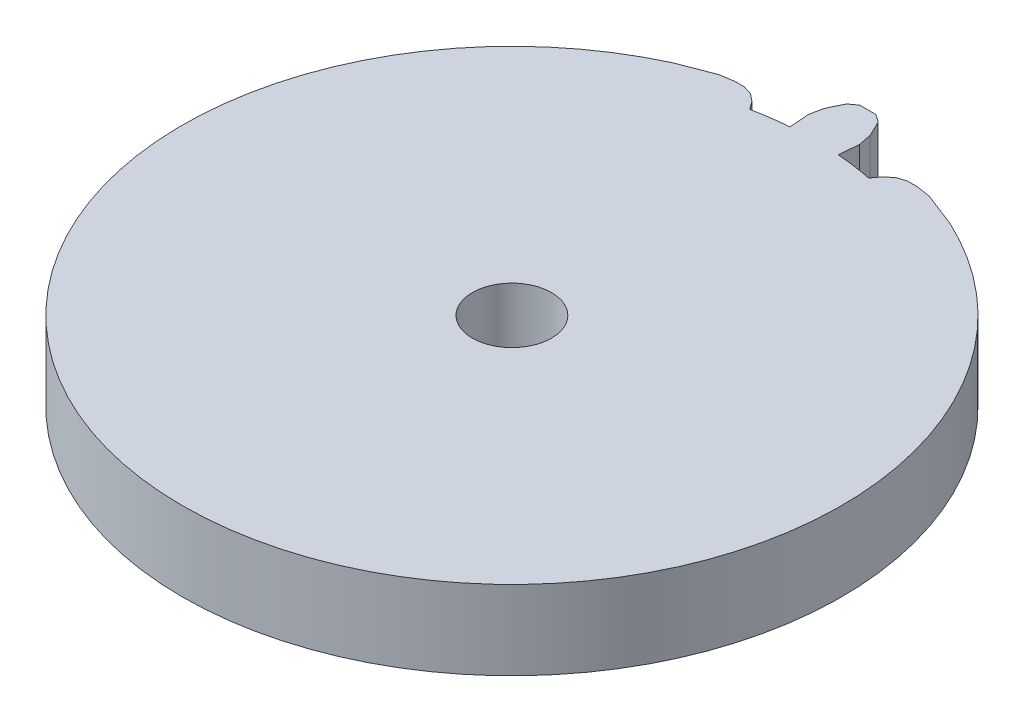
ISO-10303-21;
HEADER;
FILE_DESCRIPTION(('STEP AP214'),'2;1');
FILE_NAME('part.step','',(''),(''),'','','');
FILE_SCHEMA(('AUTOMOTIVE_DESIGN { 1 0 10303 214 1 1 1 1 }'));
ENDSEC;
DATA;
#1=APPLICATION_CONTEXT('core data for automotive mechanical design processes');
#2=APPLICATION_PROTOCOL_DEFINITION('international standard','automotive_design',2000,#1);
#3=PRODUCT_CONTEXT('',#1,'mechanical');
#4=PRODUCT('Part','Part','',(#3));
#5=PRODUCT_RELATED_PRODUCT_CATEGORY('part','',(#4));
#6=PRODUCT_DEFINITION_FORMATION('','',#4);
#7=PRODUCT_DEFINITION_CONTEXT('part definition',#1,'design');
#8=PRODUCT_DEFINITION('design','',#6,#7);
#9=PRODUCT_DEFINITION_SHAPE('','',#8);
#10=(LENGTH_UNIT() NAMED_UNIT(*) SI_UNIT(.MILLI.,.METRE.));
#11=(NAMED_UNIT(*) PLANE_ANGLE_UNIT() SI_UNIT($,.RADIAN.));
#12=(NAMED_UNIT(*) SI_UNIT($,.STERADIAN.) SOLID_ANGLE_UNIT());
#13=UNCERTAINTY_MEASURE_WITH_UNIT(LENGTH_MEASURE(1.E-05),#10,'distance_accuracy_value','');
#14=(GEOMETRIC_REPRESENTATION_CONTEXT(3) GLOBAL_UNCERTAINTY_ASSIGNED_CONTEXT((#13)) GLOBAL_UNIT_ASSIGNED_CONTEXT((#10,
#11,#12)) REPRESENTATION_CONTEXT('',''));
#15=CARTESIAN_POINT('',(0.,0.,0.));
#16=DIRECTION('',(0.,0.,1.));
#17=DIRECTION('',(1.,0.,0.));
#18=AXIS2_PLACEMENT_3D('',#15,#16,#17);
#19=CARTESIAN_POINT('',(-90.7746759823207,6.,-51.8445096665976));
#20=DIRECTION('',(0.,1.,0.));
#21=DIRECTION('',(0.,0.,1.));
#22=AXIS2_PLACEMENT_3D('',#19,#20,#21);
#23=PLANE('',#22);
#24=DIRECTION('',(-0.952984592312304,0.,0.303018756540502));
#25=VECTOR('',#24,1.);
#26=CARTESIAN_POINT('',(-85.5282944289775,6.,-75.3733161752729));
#27=LINE('',#26,#25);
#28=CARTESIAN_POINT('',(-84.59079600391,6.,-75.6714108237219));
#29=VERTEX_POINT('',#28);
#30=CARTESIAN_POINT('',(-85.2504317504003,6.,-75.4616676596838));
#31=VERTEX_POINT('',#30);
#32=EDGE_CURVE('E227',#29,#31,#27,.T.);
#33=ORIENTED_EDGE('',*,*,#32,.T.);
#34=DIRECTION('',(-0.778499469402873,0.,0.627645262978575));
#35=VECTOR('',#34,1.);
#36=CARTESIAN_POINT('',(-85.8165764895965,6.,-75.0052279603873));
#37=LINE('',#36,#35);
#38=CARTESIAN_POINT('',(-85.8165764895965,6.,-75.0052279603873));
#39=VERTEX_POINT('',#38);
#40=EDGE_CURVE('E371',#31,#39,#37,.T.);
#41=ORIENTED_EDGE('',*,*,#40,.T.);
#42=DIRECTION('',(-0.593111348272664,0.,0.805120443505307));
#43=VECTOR('',#42,1.);
#44=CARTESIAN_POINT('',(-84.965694111632,6.,-76.1602603156318));
#45=LINE('',#44,#43);
#46=CARTESIAN_POINT('',(-86.2640048761558,6.,-74.3978652078914));
#47=VERTEX_POINT('',#46);
#48=EDGE_CURVE('E261',#39,#47,#45,.T.);
#49=ORIENTED_EDGE('',*,*,#48,.T.);
#50=CARTESIAN_POINT('',(-90.7746759823207,6.,-51.8445096665976));
#51=DIRECTION('',(0.,1.,0.));
#52=DIRECTION('',(0.,0.,1.));
#53=AXIS2_PLACEMENT_3D('',#50,#51,#52);
#54=CIRCLE('',#53,22.9999999999999);
#55=CARTESIAN_POINT('',(-88.9405358698143,6.,-74.7712610729284));
#56=VERTEX_POINT('',#55);
#57=EDGE_CURVE('E287',#47,#56,#54,.T.);
#58=ORIENTED_EDGE('',*,*,#57,.T.);
#59=DIRECTION('',(0.0797452222828837,0.,-0.996815278536126));
#60=VECTOR('',#59,1.);
#61=CARTESIAN_POINT('',(-88.7810454252486,6.,-76.7648916300007));
#62=LINE('',#61,#60);
#63=CARTESIAN_POINT('',(-88.8208552253991,6.,-76.2672691281194));
#64=VERTEX_POINT('',#63);
#65=EDGE_CURVE('E283',#56,#64,#62,.T.);
#66=ORIENTED_EDGE('',*,*,#65,.T.);
#67=DIRECTION('',(-0.194233291171747,0.,-0.980955365243797));
#68=VECTOR('',#67,1.);
#69=CARTESIAN_POINT('',(-88.8208552253991,6.,-76.2672691281194));
#70=LINE('',#69,#68);
#71=CARTESIAN_POINT('',(-89.0172888523159,6.,-77.2593370639298));
#72=VERTEX_POINT('',#71);
#73=EDGE_CURVE('E354',#64,#72,#70,.T.);
#74=ORIENTED_EDGE('',*,*,#73,.T.);
#75=DIRECTION('',(-0.431113171841939,0.,-0.902297862717397));
#76=VECTOR('',#75,1.);
#77=CARTESIAN_POINT('',(-88.7810454252486,6.,-76.7648916300007));
#78=LINE('',#77,#76);
#79=CARTESIAN_POINT('',(-89.5731249178315,6.,-78.4226735766909));
#80=VERTEX_POINT('',#79);
#81=EDGE_CURVE('E286',#72,#80,#78,.T.);
#82=ORIENTED_EDGE('',*,*,#81,.T.);
#83=DIRECTION('',(-0.809342169613385,0.,-0.58733742643007));
#84=VECTOR('',#83,1.);
#85=CARTESIAN_POINT('',(-89.5731249178315,6.,-78.4226735766909));
#86=LINE('',#85,#84);
#87=CARTESIAN_POINT('',(-90.1544087265298,6.,-78.8445096665976));
#88=VERTEX_POINT('',#87);
#89=EDGE_CURVE('E344',#80,#88,#86,.T.);
#90=ORIENTED_EDGE('',*,*,#89,.T.);
#91=DIRECTION('',(-1.,0.,0.));
#92=VECTOR('',#91,1.);
#93=CARTESIAN_POINT('',(-89.7746759823208,6.,-78.8445096665976));
#94=LINE('',#93,#92);
#95=CARTESIAN_POINT('',(-91.3949432381118,6.,-78.8445096665976));
#96=VERTEX_POINT('',#95);
#97=EDGE_CURVE('E294',#88,#96,#94,.T.);
#98=ORIENTED_EDGE('',*,*,#97,.T.);
#99=DIRECTION('',(-0.809342169613385,0.,0.58733742643007));
#100=VECTOR('',#99,1.);
#101=CARTESIAN_POINT('',(-91.9762270468101,6.,-78.4226735766909));
#102=LINE('',#101,#100);
#103=CARTESIAN_POINT('',(-91.9762270468101,6.,-78.4226735766909));
#104=VERTEX_POINT('',#103);
#105=EDGE_CURVE('E333',#96,#104,#102,.T.);
#106=ORIENTED_EDGE('',*,*,#105,.T.);
#107=DIRECTION('',(-0.431113171841939,0.,0.902297862717397));
#108=VECTOR('',#107,1.);
#109=CARTESIAN_POINT('',(-92.7683065393931,6.,-76.7648916300007));
#110=LINE('',#109,#108);
#111=CARTESIAN_POINT('',(-92.5320631123257,6.,-77.2593370639298));
#112=VERTEX_POINT('',#111);
#113=EDGE_CURVE('E291',#104,#112,#110,.T.);
#114=ORIENTED_EDGE('',*,*,#113,.T.);
#115=DIRECTION('',(-0.194233291171734,0.,0.9809553652438));
#116=VECTOR('',#115,1.);
#117=CARTESIAN_POINT('',(-92.7284967392425,6.,-76.2672691281194));
#118=LINE('',#117,#116);
#119=CARTESIAN_POINT('',(-92.7284967392425,6.,-76.2672691281194));
#120=VERTEX_POINT('',#119);
#121=EDGE_CURVE('E322',#112,#120,#118,.T.);
#122=ORIENTED_EDGE('',*,*,#121,.T.);
#123=DIRECTION('',(0.0797452222828928,0.,0.996815278536125));
#124=VECTOR('',#123,1.);
#125=CARTESIAN_POINT('',(-92.7683065393931,6.,-76.7648916300007));
#126=LINE('',#125,#124);
#127=CARTESIAN_POINT('',(-92.6088160948273,6.,-74.7712610729285));
#128=VERTEX_POINT('',#127);
#129=EDGE_CURVE('E245',#120,#128,#126,.T.);
#130=ORIENTED_EDGE('',*,*,#129,.T.);
#131=CARTESIAN_POINT('',(-90.7746759823207,6.,-51.8445096665976));
#132=DIRECTION('',(0.,1.,0.));
#133=DIRECTION('',(0.,0.,1.));
#134=AXIS2_PLACEMENT_3D('',#131,#132,#133);
#135=CIRCLE('',#134,23.);
#136=CARTESIAN_POINT('',(-95.2853470884858,6.,-74.3978652078914));
#137=VERTEX_POINT('',#136);
#138=EDGE_CURVE('E241',#128,#137,#135,.T.);
#139=ORIENTED_EDGE('',*,*,#138,.T.);
#140=DIRECTION('',(-0.593111348272664,0.,-0.805120443505307));
#141=VECTOR('',#140,1.);
#142=CARTESIAN_POINT('',(-96.5836578530096,6.,-76.1602603156318));
#143=LINE('',#142,#141);
#144=CARTESIAN_POINT('',(-95.7327754750451,6.,-75.0052279603873));
#145=VERTEX_POINT('',#144);
#146=EDGE_CURVE('E236',#137,#145,#143,.T.);
#147=ORIENTED_EDGE('',*,*,#146,.T.);
#148=DIRECTION('',(-0.778499469402873,0.,-0.627645262978575));
#149=VECTOR('',#148,1.);
#150=CARTESIAN_POINT('',(-95.7327754750451,6.,-75.0052279603873));
#151=LINE('',#150,#149);
#152=CARTESIAN_POINT('',(-96.2989202142413,6.,-75.4616676596838));
#153=VERTEX_POINT('',#152);
#154=EDGE_CURVE('E363',#145,#153,#151,.T.);
#155=ORIENTED_EDGE('',*,*,#154,.T.);
#156=DIRECTION('',(-0.952984592312304,0.,-0.303018756540502));
#157=VECTOR('',#156,1.);
#158=CARTESIAN_POINT('',(-96.0210575356641,6.,-75.3733161752729));
#159=LINE('',#158,#157);
#160=CARTESIAN_POINT('',(-96.9585559607316,6.,-75.6714108237219));
#161=VERTEX_POINT('',#160);
#162=EDGE_CURVE('E52',#153,#161,#159,.T.);
#163=ORIENTED_EDGE('',*,*,#162,.T.);
#164=DIRECTION('',(-1.,0.,0.));
#165=VECTOR('',#164,1.);
#166=CARTESIAN_POINT('',(-96.9585559607316,6.,-75.6714108237219));
#167=LINE('',#166,#165);
#168=CARTESIAN_POINT('',(-97.6878845414726,6.,-75.6714108237219));
#169=VERTEX_POINT('',#168);
#170=EDGE_CURVE('E405',#161,#169,#167,.T.);
#171=ORIENTED_EDGE('',*,*,#170,.T.);
#172=DIRECTION('',(-0.987910704749329,0.,0.15502399634148));
#173=VECTOR('',#172,1.);
#174=CARTESIAN_POINT('',(-97.6878845414726,6.,-75.6714108237219));
#175=LINE('',#174,#173);
#176=CARTESIAN_POINT('',(-98.7702244107247,6.,-75.501568902661));
#177=VERTEX_POINT('',#176);
#178=EDGE_CURVE('E402',#169,#177,#175,.T.);
#179=ORIENTED_EDGE('',*,*,#178,.T.);
#180=DIRECTION('',(-0.931576817700719,0.,0.363544540218392));
#181=VECTOR('',#180,1.);
#182=CARTESIAN_POINT('',(-98.7702244107247,6.,-75.501568902661));
#183=LINE('',#182,#181);
#184=CARTESIAN_POINT('',(-100.13489394785,6.,-74.9690114688589));
#185=VERTEX_POINT('',#184);
#186=EDGE_CURVE('E400',#177,#185,#183,.T.);
#187=ORIENTED_EDGE('',*,*,#186,.T.);
#188=DIRECTION('',(-0.933303555268989,0.,0.35908839263093));
#189=VECTOR('',#188,1.);
#190=CARTESIAN_POINT('',(-100.13489394785,6.,-74.9690114688589));
#191=LINE('',#190,#189);
#192=CARTESIAN_POINT('',(-101.301738293158,6.,-74.5200682948597));
#193=VERTEX_POINT('',#192);
#194=EDGE_CURVE('E234',#185,#193,#191,.T.);
#195=ORIENTED_EDGE('',*,*,#194,.T.);
#196=CARTESIAN_POINT('',(-90.7746759823207,6.,-51.8445096665976));
#197=DIRECTION('',(0.,1.,0.));
#198=DIRECTION('',(0.,0.,1.));
#199=AXIS2_PLACEMENT_3D('',#196,#197,#198);
#200=CIRCLE('',#199,25.);
#201=CARTESIAN_POINT('',(-80.2476136714834,6.,-74.5200682948597));
#202=VERTEX_POINT('',#201);
#203=EDGE_CURVE('E38',#193,#202,#200,.T.);
#204=ORIENTED_EDGE('',*,*,#203,.T.);
#205=DIRECTION('',(-0.933303555268989,0.,-0.35908839263093));
#206=VECTOR('',#205,1.);
#207=CARTESIAN_POINT('',(-81.4144580167916,6.,-74.9690114688589));
#208=LINE('',#207,#206);
#209=CARTESIAN_POINT('',(-81.4144580167916,6.,-74.9690114688589));
#210=VERTEX_POINT('',#209);
#211=EDGE_CURVE('E208',#202,#210,#208,.T.);
#212=ORIENTED_EDGE('',*,*,#211,.T.);
#213=DIRECTION('',(-0.931576817700719,0.,-0.363544540218392));
#214=VECTOR('',#213,1.);
#215=CARTESIAN_POINT('',(-82.779127553917,6.,-75.5015689026611));
#216=LINE('',#215,#214);
#217=CARTESIAN_POINT('',(-82.779127553917,6.,-75.5015689026611));
#218=VERTEX_POINT('',#217);
#219=EDGE_CURVE('E219',#210,#218,#216,.T.);
#220=ORIENTED_EDGE('',*,*,#219,.T.);
#221=DIRECTION('',(-0.987910704749329,0.,-0.15502399634148));
#222=VECTOR('',#221,1.);
#223=CARTESIAN_POINT('',(-83.861467423169,6.,-75.6714108237219));
#224=LINE('',#223,#222);
#225=CARTESIAN_POINT('',(-83.861467423169,6.,-75.6714108237219));
#226=VERTEX_POINT('',#225);
#227=EDGE_CURVE('E430',#218,#226,#224,.T.);
#228=ORIENTED_EDGE('',*,*,#227,.T.);
#229=DIRECTION('',(-1.,0.,0.));
#230=VECTOR('',#229,1.);
#231=CARTESIAN_POINT('',(-84.59079600391,6.,-75.6714108237219));
#232=LINE('',#231,#230);
#233=EDGE_CURVE('E427',#226,#29,#232,.T.);
#234=ORIENTED_EDGE('',*,*,#233,.T.);
#235=EDGE_LOOP('',(#33,#41,#49,#58,#66,#74,#82,#90,#98,#106,#114,#122,#130,#139,#147,#155,#163,
#171,#179,#187,#195,#204,#212,#220,#228,#234));
#236=FACE_BOUND('',#235,.T.);
#237=CARTESIAN_POINT('',(-90.7746759823207,6.,-51.8445096665976));
#238=DIRECTION('',(0.,1.,0.));
#239=DIRECTION('',(0.,0.,1.));
#240=AXIS2_PLACEMENT_3D('',#237,#238,#239);
#241=CIRCLE('',#240,2.99999999999994);
#242=CARTESIAN_POINT('',(-90.7746759823207,6.,-48.8445096665977));
#243=VERTEX_POINT('',#242);
#244=EDGE_CURVE('E260',#243,#243,#241,.T.);
#245=ORIENTED_EDGE('',*,*,#244,.F.);
#246=EDGE_LOOP('',(#245));
#247=FACE_BOUND('',#246,.T.);
#248=ADVANCED_FACE('F34',(#236,#247),#23,.T.);
#249=CARTESIAN_POINT('',(-90.7746759823207,0.,-51.8445096665976));
#250=DIRECTION('',(0.,1.,0.));
#251=DIRECTION('',(0.,0.,1.));
#252=AXIS2_PLACEMENT_3D('',#249,#250,#251);
#253=PLANE('',#252);
#254=DIRECTION('',(-0.778499469402873,0.,0.627645262978575));
#255=VECTOR('',#254,1.);
#256=CARTESIAN_POINT('',(-85.8165764895965,0.,-75.0052279603873));
#257=LINE('',#256,#255);
#258=CARTESIAN_POINT('',(-85.2504317504003,0.,-75.4616676596838));
#259=VERTEX_POINT('',#258);
#260=CARTESIAN_POINT('',(-85.8165764895965,0.,-75.0052279603873));
#261=VERTEX_POINT('',#260);
#262=EDGE_CURVE('E362',#259,#261,#257,.T.);
#263=ORIENTED_EDGE('',*,*,#262,.F.);
#264=DIRECTION('',(-0.952984592312304,0.,0.303018756540502));
#265=VECTOR('',#264,1.);
#266=CARTESIAN_POINT('',(-85.5282944289775,0.,-75.3733161752729));
#267=LINE('',#266,#265);
#268=CARTESIAN_POINT('',(-84.59079600391,0.,-75.6714108237219));
#269=VERTEX_POINT('',#268);
#270=EDGE_CURVE('E59',#269,#259,#267,.T.);
#271=ORIENTED_EDGE('',*,*,#270,.F.);
#272=DIRECTION('',(-1.,0.,0.));
#273=VECTOR('',#272,1.);
#274=CARTESIAN_POINT('',(-84.59079600391,0.,-75.6714108237219));
#275=LINE('',#274,#273);
#276=CARTESIAN_POINT('',(-83.861467423169,0.,-75.6714108237219));
#277=VERTEX_POINT('',#276);
#278=EDGE_CURVE('E416',#277,#269,#275,.T.);
#279=ORIENTED_EDGE('',*,*,#278,.F.);
#280=DIRECTION('',(-0.987910704749329,0.,-0.15502399634148));
#281=VECTOR('',#280,1.);
#282=CARTESIAN_POINT('',(-83.861467423169,0.,-75.6714108237219));
#283=LINE('',#282,#281);
#284=CARTESIAN_POINT('',(-82.779127553917,0.,-75.5015689026611));
#285=VERTEX_POINT('',#284);
#286=EDGE_CURVE('E419',#285,#277,#283,.T.);
#287=ORIENTED_EDGE('',*,*,#286,.F.);
#288=DIRECTION('',(-0.931576817700719,0.,-0.363544540218392));
#289=VECTOR('',#288,1.);
#290=CARTESIAN_POINT('',(-82.779127553917,0.,-75.5015689026611));
#291=LINE('',#290,#289);
#292=CARTESIAN_POINT('',(-81.4144580167916,0.,-74.9690114688589));
#293=VERTEX_POINT('',#292);
#294=EDGE_CURVE('E422',#293,#285,#291,.T.);
#295=ORIENTED_EDGE('',*,*,#294,.F.);
#296=DIRECTION('',(-0.933303555268989,0.,-0.35908839263093));
#297=VECTOR('',#296,1.);
#298=CARTESIAN_POINT('',(-81.4144580167916,0.,-74.9690114688589));
#299=LINE('',#298,#297);
#300=CARTESIAN_POINT('',(-80.2476136714834,0.,-74.5200682948597));
#301=VERTEX_POINT('',#300);
#302=EDGE_CURVE('E385',#301,#293,#299,.T.);
#303=ORIENTED_EDGE('',*,*,#302,.F.);
#304=CARTESIAN_POINT('',(-90.7746759823207,0.,-51.8445096665976));
#305=DIRECTION('',(0.,1.,0.));
#306=DIRECTION('',(0.,0.,1.));
#307=AXIS2_PLACEMENT_3D('',#304,#305,#306);
#308=CIRCLE('',#307,25.);
#309=CARTESIAN_POINT('',(-101.301738293158,0.,-74.5200682948597));
#310=VERTEX_POINT('',#309);
#311=EDGE_CURVE('E226',#310,#301,#308,.T.);
#312=ORIENTED_EDGE('',*,*,#311,.F.);
#313=DIRECTION('',(-0.933303555268989,0.,0.35908839263093));
#314=VECTOR('',#313,1.);
#315=CARTESIAN_POINT('',(-100.13489394785,0.,-74.9690114688589));
#316=LINE('',#315,#314);
#317=CARTESIAN_POINT('',(-100.13489394785,0.,-74.9690114688589));
#318=VERTEX_POINT('',#317);
#319=EDGE_CURVE('E386',#318,#310,#316,.T.);
#320=ORIENTED_EDGE('',*,*,#319,.F.);
#321=DIRECTION('',(-0.931576817700719,0.,0.363544540218392));
#322=VECTOR('',#321,1.);
#323=CARTESIAN_POINT('',(-98.7702244107247,0.,-75.501568902661));
#324=LINE('',#323,#322);
#325=CARTESIAN_POINT('',(-98.7702244107247,0.,-75.501568902661));
#326=VERTEX_POINT('',#325);
#327=EDGE_CURVE('E388',#326,#318,#324,.T.);
#328=ORIENTED_EDGE('',*,*,#327,.F.);
#329=DIRECTION('',(-0.987910704749329,0.,0.15502399634148));
#330=VECTOR('',#329,1.);
#331=CARTESIAN_POINT('',(-97.6878845414726,0.,-75.6714108237219));
#332=LINE('',#331,#330);
#333=CARTESIAN_POINT('',(-97.6878845414726,0.,-75.6714108237219));
#334=VERTEX_POINT('',#333);
#335=EDGE_CURVE('E391',#334,#326,#332,.T.);
#336=ORIENTED_EDGE('',*,*,#335,.F.);
#337=DIRECTION('',(-1.,0.,0.));
#338=VECTOR('',#337,1.);
#339=CARTESIAN_POINT('',(-96.9585559607316,0.,-75.6714108237219));
#340=LINE('',#339,#338);
#341=CARTESIAN_POINT('',(-96.9585559607316,0.,-75.6714108237219));
#342=VERTEX_POINT('',#341);
#343=EDGE_CURVE('E394',#342,#334,#340,.T.);
#344=ORIENTED_EDGE('',*,*,#343,.F.);
#345=DIRECTION('',(-0.952984592312304,0.,-0.303018756540502));
#346=VECTOR('',#345,1.);
#347=CARTESIAN_POINT('',(-96.0210575356641,0.,-75.3733161752729));
#348=LINE('',#347,#346);
#349=CARTESIAN_POINT('',(-96.2989202142413,0.,-75.4616676596838));
#350=VERTEX_POINT('',#349);
#351=EDGE_CURVE('E397',#350,#342,#348,.T.);
#352=ORIENTED_EDGE('',*,*,#351,.F.);
#353=DIRECTION('',(-0.778499469402873,0.,-0.627645262978575));
#354=VECTOR('',#353,1.);
#355=CARTESIAN_POINT('',(-95.7327754750451,0.,-75.0052279603873));
#356=LINE('',#355,#354);
#357=CARTESIAN_POINT('',(-95.7327754750451,0.,-75.0052279603873));
#358=VERTEX_POINT('',#357);
#359=EDGE_CURVE('E364',#358,#350,#356,.T.);
#360=ORIENTED_EDGE('',*,*,#359,.F.);
#361=DIRECTION('',(-0.593111348272664,0.,-0.805120443505307));
#362=VECTOR('',#361,1.);
#363=CARTESIAN_POINT('',(-96.5836578530096,0.,-76.1602603156318));
#364=LINE('',#363,#362);
#365=CARTESIAN_POINT('',(-95.2853470884858,0.,-74.3978652078914));
#366=VERTEX_POINT('',#365);
#367=EDGE_CURVE('E259',#366,#358,#364,.T.);
#368=ORIENTED_EDGE('',*,*,#367,.F.);
#369=CARTESIAN_POINT('',(-90.7746759823207,0.,-51.8445096665976));
#370=DIRECTION('',(0.,1.,0.));
#371=DIRECTION('',(0.,0.,1.));
#372=AXIS2_PLACEMENT_3D('',#369,#370,#371);
#373=CIRCLE('',#372,23.);
#374=CARTESIAN_POINT('',(-92.6088160948273,0.,-74.7712610729285));
#375=VERTEX_POINT('',#374);
#376=EDGE_CURVE('E270',#375,#366,#373,.T.);
#377=ORIENTED_EDGE('',*,*,#376,.F.);
#378=DIRECTION('',(0.0797452222828928,0.,0.996815278536125));
#379=VECTOR('',#378,1.);
#380=CARTESIAN_POINT('',(-92.7683065393931,0.,-76.7648916300007));
#381=LINE('',#380,#379);
#382=CARTESIAN_POINT('',(-92.7284967392425,0.,-76.2672691281194));
#383=VERTEX_POINT('',#382);
#384=EDGE_CURVE('E273',#383,#375,#381,.T.);
#385=ORIENTED_EDGE('',*,*,#384,.F.);
#386=DIRECTION('',(-0.194233291171734,0.,0.9809553652438));
#387=VECTOR('',#386,1.);
#388=CARTESIAN_POINT('',(-92.7284967392425,0.,-76.2672691281194));
#389=LINE('',#388,#387);
#390=CARTESIAN_POINT('',(-92.5320631123257,0.,-77.2593370639298));
#391=VERTEX_POINT('',#390);
#392=EDGE_CURVE('E331',#391,#383,#389,.T.);
#393=ORIENTED_EDGE('',*,*,#392,.F.);
#394=DIRECTION('',(-0.431113171841939,0.,0.902297862717397));
#395=VECTOR('',#394,1.);
#396=CARTESIAN_POINT('',(-92.7683065393931,0.,-76.7648916300007));
#397=LINE('',#396,#395);
#398=CARTESIAN_POINT('',(-91.9762270468101,0.,-78.4226735766909));
#399=VERTEX_POINT('',#398);
#400=EDGE_CURVE('E275',#399,#391,#397,.T.);
#401=ORIENTED_EDGE('',*,*,#400,.F.);
#402=DIRECTION('',(-0.809342169613385,0.,0.58733742643007));
#403=VECTOR('',#402,1.);
#404=CARTESIAN_POINT('',(-91.9762270468101,0.,-78.4226735766909));
#405=LINE('',#404,#403);
#406=CARTESIAN_POINT('',(-91.3949432381118,0.,-78.8445096665976));
#407=VERTEX_POINT('',#406);
#408=EDGE_CURVE('E334',#407,#399,#405,.T.);
#409=ORIENTED_EDGE('',*,*,#408,.F.);
#410=DIRECTION('',(-1.,0.,0.));
#411=VECTOR('',#410,1.);
#412=CARTESIAN_POINT('',(-89.7746759823208,0.,-78.8445096665976));
#413=LINE('',#412,#411);
#414=CARTESIAN_POINT('',(-90.1544087265298,0.,-78.8445096665976));
#415=VERTEX_POINT('',#414);
#416=EDGE_CURVE('E278',#415,#407,#413,.T.);
#417=ORIENTED_EDGE('',*,*,#416,.F.);
#418=DIRECTION('',(-0.809342169613385,0.,-0.58733742643007));
#419=VECTOR('',#418,1.);
#420=CARTESIAN_POINT('',(-89.5731249178315,0.,-78.4226735766909));
#421=LINE('',#420,#419);
#422=CARTESIAN_POINT('',(-89.5731249178315,0.,-78.4226735766909));
#423=VERTEX_POINT('',#422);
#424=EDGE_CURVE('E352',#423,#415,#421,.T.);
#425=ORIENTED_EDGE('',*,*,#424,.F.);
#426=DIRECTION('',(-0.431113171841939,0.,-0.902297862717397));
#427=VECTOR('',#426,1.);
#428=CARTESIAN_POINT('',(-88.7810454252486,0.,-76.7648916300007));
#429=LINE('',#428,#427);
#430=CARTESIAN_POINT('',(-89.0172888523159,0.,-77.2593370639298));
#431=VERTEX_POINT('',#430);
#432=EDGE_CURVE('E238',#431,#423,#429,.T.);
#433=ORIENTED_EDGE('',*,*,#432,.F.);
#434=DIRECTION('',(-0.194233291171747,0.,-0.980955365243797));
#435=VECTOR('',#434,1.);
#436=CARTESIAN_POINT('',(-88.8208552253991,0.,-76.2672691281194));
#437=LINE('',#436,#435);
#438=CARTESIAN_POINT('',(-88.8208552253991,0.,-76.2672691281194));
#439=VERTEX_POINT('',#438);
#440=EDGE_CURVE('E330',#439,#431,#437,.T.);
#441=ORIENTED_EDGE('',*,*,#440,.F.);
#442=DIRECTION('',(0.0797452222828837,0.,-0.996815278536126));
#443=VECTOR('',#442,1.);
#444=CARTESIAN_POINT('',(-88.7810454252486,0.,-76.7648916300007));
#445=LINE('',#444,#443);
#446=CARTESIAN_POINT('',(-88.9405358698143,0.,-74.7712610729284));
#447=VERTEX_POINT('',#446);
#448=EDGE_CURVE('E305',#447,#439,#445,.T.);
#449=ORIENTED_EDGE('',*,*,#448,.F.);
#450=CARTESIAN_POINT('',(-90.7746759823207,0.,-51.8445096665976));
#451=DIRECTION('',(0.,1.,0.));
#452=DIRECTION('',(0.,0.,1.));
#453=AXIS2_PLACEMENT_3D('',#450,#451,#452);
#454=CIRCLE('',#453,22.9999999999999);
#455=CARTESIAN_POINT('',(-86.2640048761558,0.,-74.3978652078914));
#456=VERTEX_POINT('',#455);
#457=EDGE_CURVE('E264',#456,#447,#454,.T.);
#458=ORIENTED_EDGE('',*,*,#457,.F.);
#459=DIRECTION('',(-0.593111348272664,0.,0.805120443505307));
#460=VECTOR('',#459,1.);
#461=CARTESIAN_POINT('',(-84.965694111632,0.,-76.1602603156318));
#462=LINE('',#461,#460);
#463=EDGE_CURVE('E256',#261,#456,#462,.T.);
#464=ORIENTED_EDGE('',*,*,#463,.F.);
#465=EDGE_LOOP('',(#263,#271,#279,#287,#295,#303,#312,#320,#328,#336,#344,#352,#360,#368,#377,
#385,#393,#401,#409,#417,#425,#433,#441,#449,#458,#464));
#466=FACE_BOUND('',#465,.T.);
#467=CARTESIAN_POINT('',(-90.7746759823207,0.,-51.8445096665976));
#468=DIRECTION('',(0.,1.,0.));
#469=DIRECTION('',(0.,0.,1.));
#470=AXIS2_PLACEMENT_3D('',#467,#468,#469);
#471=CIRCLE('',#470,2.99999999999994);
#472=CARTESIAN_POINT('',(-90.7746759823207,0.,-48.8445096665977));
#473=VERTEX_POINT('',#472);
#474=EDGE_CURVE('E235',#473,#473,#471,.T.);
#475=ORIENTED_EDGE('',*,*,#474,.T.);
#476=EDGE_LOOP('',(#475));
#477=FACE_BOUND('',#476,.T.);
#478=ADVANCED_FACE('F466',(#466,#477),#253,.F.);
#479=CARTESIAN_POINT('',(-88.7810454252486,6.,-76.7648916300007));
#480=DIRECTION('',(-0.902297862717397,0.,0.431113171841939));
#481=DIRECTION('',(0.431113171841939,0.,0.902297862717397));
#482=AXIS2_PLACEMENT_3D('',#479,#480,#481);
#483=PLANE('',#482);
#484=ORIENTED_EDGE('',*,*,#432,.T.);
#485=DIRECTION('',(0.,-1.,0.));
#486=VECTOR('',#485,1.);
#487=CARTESIAN_POINT('',(-89.5731249178315,6.,-78.4226735766909));
#488=LINE('',#487,#486);
#489=EDGE_CURVE('E347',#80,#423,#488,.T.);
#490=ORIENTED_EDGE('',*,*,#489,.F.);
#491=ORIENTED_EDGE('',*,*,#81,.F.);
#492=DIRECTION('',(0.,-1.,0.));
#493=VECTOR('',#492,1.);
#494=CARTESIAN_POINT('',(-89.0172888523159,6.,-77.2593370639298));
#495=LINE('',#494,#493);
#496=EDGE_CURVE('E343',#72,#431,#495,.T.);
#497=ORIENTED_EDGE('',*,*,#496,.T.);
#498=EDGE_LOOP('',(#484,#490,#491,#497));
#499=FACE_BOUND('',#498,.T.);
#500=ADVANCED_FACE('F472',(#499),#483,.F.);
#501=CARTESIAN_POINT('',(-89.7746759823208,6.,-78.8445096665976));
#502=DIRECTION('',(0.,0.,1.));
#503=DIRECTION('',(1.,0.,0.));
#504=AXIS2_PLACEMENT_3D('',#501,#502,#503);
#505=PLANE('',#504);
#506=ORIENTED_EDGE('',*,*,#97,.F.);
#507=DIRECTION('',(0.,-1.,0.));
#508=VECTOR('',#507,1.);
#509=CARTESIAN_POINT('',(-90.1544087265298,6.,-78.8445096665976));
#510=LINE('',#509,#508);
#511=EDGE_CURVE('E349',#88,#415,#510,.T.);
#512=ORIENTED_EDGE('',*,*,#511,.T.);
#513=ORIENTED_EDGE('',*,*,#416,.T.);
#514=DIRECTION('',(0.,-1.,0.));
#515=VECTOR('',#514,1.);
#516=CARTESIAN_POINT('',(-91.3949432381118,6.,-78.8445096665976));
#517=LINE('',#516,#515);
#518=EDGE_CURVE('E319',#96,#407,#517,.T.);
#519=ORIENTED_EDGE('',*,*,#518,.F.);
#520=EDGE_LOOP('',(#506,#512,#513,#519));
#521=FACE_BOUND('',#520,.T.);
#522=ADVANCED_FACE('F478',(#521),#505,.F.);
#523=CARTESIAN_POINT('',(-92.7683065393931,6.,-76.7648916300007));
#524=DIRECTION('',(0.902297862717397,0.,0.431113171841939));
#525=DIRECTION('',(0.431113171841939,0.,-0.902297862717397));
#526=AXIS2_PLACEMENT_3D('',#523,#524,#525);
#527=PLANE('',#526);
#528=ORIENTED_EDGE('',*,*,#400,.T.);
#529=DIRECTION('',(0.,-1.,0.));
#530=VECTOR('',#529,1.);
#531=CARTESIAN_POINT('',(-92.5320631123257,6.,-77.2593370639298));
#532=LINE('',#531,#530);
#533=EDGE_CURVE('E325',#112,#391,#532,.T.);
#534=ORIENTED_EDGE('',*,*,#533,.F.);
#535=ORIENTED_EDGE('',*,*,#113,.F.);
#536=DIRECTION('',(0.,-1.,0.));
#537=VECTOR('',#536,1.);
#538=CARTESIAN_POINT('',(-91.9762270468101,6.,-78.4226735766909));
#539=LINE('',#538,#537);
#540=EDGE_CURVE('E321',#104,#399,#539,.T.);
#541=ORIENTED_EDGE('',*,*,#540,.T.);
#542=EDGE_LOOP('',(#528,#534,#535,#541));
#543=FACE_BOUND('',#542,.T.);
#544=ADVANCED_FACE('F487',(#543),#527,.F.);
#545=CARTESIAN_POINT('',(-92.7683065393931,6.,-76.7648916300007));
#546=DIRECTION('',(0.996815278536125,0.,-0.0797452222828928));
#547=DIRECTION('',(-0.0797452222828928,0.,-0.996815278536125));
#548=AXIS2_PLACEMENT_3D('',#545,#546,#547);
#549=PLANE('',#548);
#550=ORIENTED_EDGE('',*,*,#129,.F.);
#551=DIRECTION('',(0.,-1.,0.));
#552=VECTOR('',#551,1.);
#553=CARTESIAN_POINT('',(-92.7284967392425,6.,-76.2672691281194));
#554=LINE('',#553,#552);
#555=EDGE_CURVE('E327',#120,#383,#554,.T.);
#556=ORIENTED_EDGE('',*,*,#555,.T.);
#557=ORIENTED_EDGE('',*,*,#384,.T.);
#558=DIRECTION('',(0.,-1.,0.));
#559=VECTOR('',#558,1.);
#560=CARTESIAN_POINT('',(-92.6088160948273,6.,-74.7712610729285));
#561=LINE('',#560,#559);
#562=EDGE_CURVE('E265',#128,#375,#561,.T.);
#563=ORIENTED_EDGE('',*,*,#562,.F.);
#564=EDGE_LOOP('',(#550,#556,#557,#563));
#565=FACE_BOUND('',#564,.T.);
#566=ADVANCED_FACE('F493',(#565),#549,.F.);
#567=CARTESIAN_POINT('',(-90.7746759823207,6.,-51.8445096665976));
#568=DIRECTION('',(0.,-1.,0.));
#569=DIRECTION('',(0.,0.,-1.));
#570=AXIS2_PLACEMENT_3D('',#567,#568,#569);
#571=CYLINDRICAL_SURFACE('',#570,23.);
#572=ORIENTED_EDGE('',*,*,#376,.T.);
#573=DIRECTION('',(0.,-1.,0.));
#574=VECTOR('',#573,1.);
#575=CARTESIAN_POINT('',(-95.2853470884859,6.,-74.3978652078914));
#576=LINE('',#575,#574);
#577=EDGE_CURVE('E262',#137,#366,#576,.T.);
#578=ORIENTED_EDGE('',*,*,#577,.F.);
#579=ORIENTED_EDGE('',*,*,#138,.F.);
#580=ORIENTED_EDGE('',*,*,#562,.T.);
#581=EDGE_LOOP('',(#572,#578,#579,#580));
#582=FACE_BOUND('',#581,.T.);
#583=ADVANCED_FACE('F498',(#582),#571,.T.);
#584=CARTESIAN_POINT('',(-90.7746759823207,6.,-51.8445096665976));
#585=DIRECTION('',(0.,-1.,0.));
#586=DIRECTION('',(0.,0.,-1.));
#587=AXIS2_PLACEMENT_3D('',#584,#585,#586);
#588=CYLINDRICAL_SURFACE('',#587,25.);
#589=ORIENTED_EDGE('',*,*,#311,.T.);
#590=DIRECTION('',(0.,-1.,0.));
#591=VECTOR('',#590,1.);
#592=CARTESIAN_POINT('',(-80.2476136714834,6.,-74.5200682948597));
#593=LINE('',#592,#591);
#594=EDGE_CURVE('E212',#202,#301,#593,.T.);
#595=ORIENTED_EDGE('',*,*,#594,.F.);
#596=ORIENTED_EDGE('',*,*,#203,.F.);
#597=DIRECTION('',(0.,-1.,0.));
#598=VECTOR('',#597,1.);
#599=CARTESIAN_POINT('',(-101.301738293158,6.,-74.5200682948597));
#600=LINE('',#599,#598);
#601=EDGE_CURVE('E383',#193,#310,#600,.T.);
#602=ORIENTED_EDGE('',*,*,#601,.T.);
#603=EDGE_LOOP('',(#589,#595,#596,#602));
#604=FACE_BOUND('',#603,.T.);
#605=ADVANCED_FACE('F36',(#604),#588,.T.);
#606=CARTESIAN_POINT('',(-90.7746759823207,6.,-51.8445096665976));
#607=DIRECTION('',(0.,-1.,0.));
#608=DIRECTION('',(0.,0.,-1.));
#609=AXIS2_PLACEMENT_3D('',#606,#607,#608);
#610=CYLINDRICAL_SURFACE('',#609,22.9999999999999);
#611=ORIENTED_EDGE('',*,*,#457,.T.);
#612=DIRECTION('',(0.,-1.,0.));
#613=VECTOR('',#612,1.);
#614=CARTESIAN_POINT('',(-88.9405358698143,6.,-74.7712610729284));
#615=LINE('',#614,#613);
#616=EDGE_CURVE('E300',#56,#447,#615,.T.);
#617=ORIENTED_EDGE('',*,*,#616,.F.);
#618=ORIENTED_EDGE('',*,*,#57,.F.);
#619=DIRECTION('',(0.,-1.,0.));
#620=VECTOR('',#619,1.);
#621=CARTESIAN_POINT('',(-86.2640048761558,6.,-74.3978652078914));
#622=LINE('',#621,#620);
#623=EDGE_CURVE('E312',#47,#456,#622,.T.);
#624=ORIENTED_EDGE('',*,*,#623,.T.);
#625=EDGE_LOOP('',(#611,#617,#618,#624));
#626=FACE_BOUND('',#625,.T.);
#627=ADVANCED_FACE('F457',(#626),#610,.T.);
#628=CARTESIAN_POINT('',(-88.7810454252486,6.,-76.7648916300007));
#629=DIRECTION('',(-0.996815278536125,0.,-0.0797452222828837));
#630=DIRECTION('',(-0.0797452222828837,0.,0.996815278536126));
#631=AXIS2_PLACEMENT_3D('',#628,#629,#630);
#632=PLANE('',#631);
#633=ORIENTED_EDGE('',*,*,#448,.T.);
#634=DIRECTION('',(0.,-1.,0.));
#635=VECTOR('',#634,1.);
#636=CARTESIAN_POINT('',(-88.8208552253991,6.,-76.2672691281194));
#637=LINE('',#636,#635);
#638=EDGE_CURVE('E341',#64,#439,#637,.T.);
#639=ORIENTED_EDGE('',*,*,#638,.F.);
#640=ORIENTED_EDGE('',*,*,#65,.F.);
#641=ORIENTED_EDGE('',*,*,#616,.T.);
#642=EDGE_LOOP('',(#633,#639,#640,#641));
#643=FACE_BOUND('',#642,.T.);
#644=ADVANCED_FACE('F460',(#643),#632,.F.);
#645=CARTESIAN_POINT('',(-90.7746759823207,6.,-51.8445096665976));
#646=DIRECTION('',(0.,-1.,0.));
#647=DIRECTION('',(0.,0.,-1.));
#648=AXIS2_PLACEMENT_3D('',#645,#646,#647);
#649=CYLINDRICAL_SURFACE('',#648,2.99999999999994);
#650=ORIENTED_EDGE('',*,*,#244,.T.);
#651=EDGE_LOOP('',(#650));
#652=FACE_BOUND('',#651,.T.);
#653=ORIENTED_EDGE('',*,*,#474,.F.);
#654=EDGE_LOOP('',(#653));
#655=FACE_BOUND('',#654,.T.);
#656=ADVANCED_FACE('F542',(#652,#655),#649,.F.);
#657=CARTESIAN_POINT('',(-84.965694111632,6.,-76.1602603156318));
#658=DIRECTION('',(0.805120443505308,0.,0.593111348272664));
#659=DIRECTION('',(0.593111348272664,0.,-0.805120443505308));
#660=AXIS2_PLACEMENT_3D('',#657,#658,#659);
#661=PLANE('',#660);
#662=ORIENTED_EDGE('',*,*,#48,.F.);
#663=DIRECTION('',(0.,-1.,0.));
#664=VECTOR('',#663,1.);
#665=CARTESIAN_POINT('',(-85.8165764895965,6.,-75.0052279603873));
#666=LINE('',#665,#664);
#667=EDGE_CURVE('E336',#39,#261,#666,.T.);
#668=ORIENTED_EDGE('',*,*,#667,.T.);
#669=ORIENTED_EDGE('',*,*,#463,.T.);
#670=ORIENTED_EDGE('',*,*,#623,.F.);
#671=EDGE_LOOP('',(#662,#668,#669,#670));
#672=FACE_BOUND('',#671,.T.);
#673=ADVANCED_FACE('F454',(#672),#661,.F.);
#674=CARTESIAN_POINT('',(-96.5836578530096,6.,-76.1602603156318));
#675=DIRECTION('',(-0.805120443505308,0.,0.593111348272664));
#676=DIRECTION('',(0.593111348272664,0.,0.805120443505308));
#677=AXIS2_PLACEMENT_3D('',#674,#675,#676);
#678=PLANE('',#677);
#679=ORIENTED_EDGE('',*,*,#367,.T.);
#680=DIRECTION('',(0.,-1.,0.));
#681=VECTOR('',#680,1.);
#682=CARTESIAN_POINT('',(-95.7327754750451,6.,-75.0052279603873));
#683=LINE('',#682,#681);
#684=EDGE_CURVE('E360',#145,#358,#683,.T.);
#685=ORIENTED_EDGE('',*,*,#684,.F.);
#686=ORIENTED_EDGE('',*,*,#146,.F.);
#687=ORIENTED_EDGE('',*,*,#577,.T.);
#688=EDGE_LOOP('',(#679,#685,#686,#687));
#689=FACE_BOUND('',#688,.T.);
#690=ADVANCED_FACE('F502',(#689),#678,.F.);
#691=CARTESIAN_POINT('',(-88.8208552253991,6.,-76.2672691281194));
#692=DIRECTION('',(-0.980955365243797,0.,0.194233291171747));
#693=DIRECTION('',(0.194233291171747,0.,0.980955365243797));
#694=AXIS2_PLACEMENT_3D('',#691,#692,#693);
#695=PLANE('',#694);
#696=ORIENTED_EDGE('',*,*,#440,.T.);
#697=ORIENTED_EDGE('',*,*,#496,.F.);
#698=ORIENTED_EDGE('',*,*,#73,.F.);
#699=ORIENTED_EDGE('',*,*,#638,.T.);
#700=EDGE_LOOP('',(#696,#697,#698,#699));
#701=FACE_BOUND('',#700,.T.);
#702=ADVANCED_FACE('F463',(#701),#695,.F.);
#703=CARTESIAN_POINT('',(-92.7284967392425,6.,-76.2672691281194));
#704=DIRECTION('',(0.9809553652438,0.,0.194233291171734));
#705=DIRECTION('',(0.194233291171734,0.,-0.9809553652438));
#706=AXIS2_PLACEMENT_3D('',#703,#704,#705);
#707=PLANE('',#706);
#708=ORIENTED_EDGE('',*,*,#392,.T.);
#709=ORIENTED_EDGE('',*,*,#555,.F.);
#710=ORIENTED_EDGE('',*,*,#121,.F.);
#711=ORIENTED_EDGE('',*,*,#533,.T.);
#712=EDGE_LOOP('',(#708,#709,#710,#711));
#713=FACE_BOUND('',#712,.T.);
#714=ADVANCED_FACE('F563',(#713),#707,.F.);
#715=CARTESIAN_POINT('',(-91.9762270468101,6.,-78.4226735766909));
#716=DIRECTION('',(0.58733742643007,0.,0.809342169613385));
#717=DIRECTION('',(0.809342169613385,0.,-0.58733742643007));
#718=AXIS2_PLACEMENT_3D('',#715,#716,#717);
#719=PLANE('',#718);
#720=ORIENTED_EDGE('',*,*,#408,.T.);
#721=ORIENTED_EDGE('',*,*,#540,.F.);
#722=ORIENTED_EDGE('',*,*,#105,.F.);
#723=ORIENTED_EDGE('',*,*,#518,.T.);
#724=EDGE_LOOP('',(#720,#721,#722,#723));
#725=FACE_BOUND('',#724,.T.);
#726=ADVANCED_FACE('F481',(#725),#719,.F.);
#727=CARTESIAN_POINT('',(-89.5731249178315,6.,-78.4226735766909));
#728=DIRECTION('',(-0.58733742643007,0.,0.809342169613385));
#729=DIRECTION('',(0.809342169613385,0.,0.58733742643007));
#730=AXIS2_PLACEMENT_3D('',#727,#728,#729);
#731=PLANE('',#730);
#732=ORIENTED_EDGE('',*,*,#424,.T.);
#733=ORIENTED_EDGE('',*,*,#511,.F.);
#734=ORIENTED_EDGE('',*,*,#89,.F.);
#735=ORIENTED_EDGE('',*,*,#489,.T.);
#736=EDGE_LOOP('',(#732,#733,#734,#735));
#737=FACE_BOUND('',#736,.T.);
#738=ADVANCED_FACE('F577',(#737),#731,.F.);
#739=CARTESIAN_POINT('',(-95.7327754750451,6.,-75.0052279603873));
#740=DIRECTION('',(-0.627645262978575,0.,0.778499469402873));
#741=DIRECTION('',(0.778499469402873,0.,0.627645262978575));
#742=AXIS2_PLACEMENT_3D('',#739,#740,#741);
#743=PLANE('',#742);
#744=ORIENTED_EDGE('',*,*,#359,.T.);
#745=DIRECTION('',(0.,1.,0.));
#746=VECTOR('',#745,1.);
#747=CARTESIAN_POINT('',(-96.2989202142413,6.,-75.4616676596838));
#748=LINE('',#747,#746);
#749=EDGE_CURVE('E11',#350,#153,#748,.T.);
#750=ORIENTED_EDGE('',*,*,#749,.T.);
#751=ORIENTED_EDGE('',*,*,#154,.F.);
#752=ORIENTED_EDGE('',*,*,#684,.T.);
#753=EDGE_LOOP('',(#744,#750,#751,#752));
#754=FACE_BOUND('',#753,.T.);
#755=ADVANCED_FACE('F508',(#754),#743,.F.);
#756=CARTESIAN_POINT('',(-85.8165764895965,6.,-75.0052279603873));
#757=DIRECTION('',(0.627645262978575,0.,0.778499469402873));
#758=DIRECTION('',(0.778499469402873,0.,-0.627645262978575));
#759=AXIS2_PLACEMENT_3D('',#756,#757,#758);
#760=PLANE('',#759);
#761=ORIENTED_EDGE('',*,*,#40,.F.);
#762=DIRECTION('',(0.,-1.,0.));
#763=VECTOR('',#762,1.);
#764=CARTESIAN_POINT('',(-85.2504317504003,6.,-75.4616676596838));
#765=LINE('',#764,#763);
#766=EDGE_CURVE('E44',#31,#259,#765,.T.);
#767=ORIENTED_EDGE('',*,*,#766,.T.);
#768=ORIENTED_EDGE('',*,*,#262,.T.);
#769=ORIENTED_EDGE('',*,*,#667,.F.);
#770=EDGE_LOOP('',(#761,#767,#768,#769));
#771=FACE_BOUND('',#770,.T.);
#772=ADVANCED_FACE('F448',(#771),#760,.F.);
#773=CARTESIAN_POINT('',(-85.5282944289775,6.,-75.3733161752729));
#774=DIRECTION('',(0.303018756540502,0.,0.952984592312304));
#775=DIRECTION('',(0.952984592312304,0.,-0.303018756540502));
#776=AXIS2_PLACEMENT_3D('',#773,#774,#775);
#777=PLANE('',#776);
#778=ORIENTED_EDGE('',*,*,#32,.F.);
#779=DIRECTION('',(0.,-1.,0.));
#780=VECTOR('',#779,1.);
#781=CARTESIAN_POINT('',(-84.59079600391,6.,-75.6714108237219));
#782=LINE('',#781,#780);
#783=EDGE_CURVE('E367',#29,#269,#782,.T.);
#784=ORIENTED_EDGE('',*,*,#783,.T.);
#785=ORIENTED_EDGE('',*,*,#270,.T.);
#786=ORIENTED_EDGE('',*,*,#766,.F.);
#787=EDGE_LOOP('',(#778,#784,#785,#786));
#788=FACE_BOUND('',#787,.T.);
#789=ADVANCED_FACE('F596',(#788),#777,.F.);
#790=CARTESIAN_POINT('',(-84.59079600391,6.,-75.6714108237219));
#791=DIRECTION('',(0.,0.,1.));
#792=DIRECTION('',(1.,0.,0.));
#793=AXIS2_PLACEMENT_3D('',#790,#791,#792);
#794=PLANE('',#793);
#795=ORIENTED_EDGE('',*,*,#278,.T.);
#796=ORIENTED_EDGE('',*,*,#783,.F.);
#797=ORIENTED_EDGE('',*,*,#233,.F.);
#798=DIRECTION('',(0.,-1.,0.));
#799=VECTOR('',#798,1.);
#800=CARTESIAN_POINT('',(-83.861467423169,6.,-75.6714108237219));
#801=LINE('',#800,#799);
#802=EDGE_CURVE('E412',#226,#277,#801,.T.);
#803=ORIENTED_EDGE('',*,*,#802,.T.);
#804=EDGE_LOOP('',(#795,#796,#797,#803));
#805=FACE_BOUND('',#804,.T.);
#806=ADVANCED_FACE('F443',(#805),#794,.F.);
#807=CARTESIAN_POINT('',(-83.861467423169,6.,-75.6714108237219));
#808=DIRECTION('',(-0.15502399634148,0.,0.987910704749329));
#809=DIRECTION('',(0.98791070474933,0.,0.15502399634148));
#810=AXIS2_PLACEMENT_3D('',#807,#808,#809);
#811=PLANE('',#810);
#812=ORIENTED_EDGE('',*,*,#286,.T.);
#813=ORIENTED_EDGE('',*,*,#802,.F.);
#814=ORIENTED_EDGE('',*,*,#227,.F.);
#815=DIRECTION('',(0.,-1.,0.));
#816=VECTOR('',#815,1.);
#817=CARTESIAN_POINT('',(-82.779127553917,6.,-75.5015689026611));
#818=LINE('',#817,#816);
#819=EDGE_CURVE('E410',#218,#285,#818,.T.);
#820=ORIENTED_EDGE('',*,*,#819,.T.);
#821=EDGE_LOOP('',(#812,#813,#814,#820));
#822=FACE_BOUND('',#821,.T.);
#823=ADVANCED_FACE('F439',(#822),#811,.F.);
#824=CARTESIAN_POINT('',(-82.779127553917,6.,-75.5015689026611));
#825=DIRECTION('',(-0.363544540218392,0.,0.931576817700719));
#826=DIRECTION('',(0.931576817700719,0.,0.363544540218392));
#827=AXIS2_PLACEMENT_3D('',#824,#825,#826);
#828=PLANE('',#827);
#829=ORIENTED_EDGE('',*,*,#294,.T.);
#830=ORIENTED_EDGE('',*,*,#819,.F.);
#831=ORIENTED_EDGE('',*,*,#219,.F.);
#832=DIRECTION('',(0.,-1.,0.));
#833=VECTOR('',#832,1.);
#834=CARTESIAN_POINT('',(-81.4144580167916,6.,-74.9690114688589));
#835=LINE('',#834,#833);
#836=EDGE_CURVE('E214',#210,#293,#835,.T.);
#837=ORIENTED_EDGE('',*,*,#836,.T.);
#838=EDGE_LOOP('',(#829,#830,#831,#837));
#839=FACE_BOUND('',#838,.T.);
#840=ADVANCED_FACE('F435',(#839),#828,.F.);
#841=CARTESIAN_POINT('',(-81.4144580167916,6.,-74.9690114688589));
#842=DIRECTION('',(-0.35908839263093,0.,0.933303555268989));
#843=DIRECTION('',(0.933303555268989,0.,0.35908839263093));
#844=AXIS2_PLACEMENT_3D('',#841,#842,#843);
#845=PLANE('',#844);
#846=ORIENTED_EDGE('',*,*,#302,.T.);
#847=ORIENTED_EDGE('',*,*,#836,.F.);
#848=ORIENTED_EDGE('',*,*,#211,.F.);
#849=ORIENTED_EDGE('',*,*,#594,.T.);
#850=EDGE_LOOP('',(#846,#847,#848,#849));
#851=FACE_BOUND('',#850,.T.);
#852=ADVANCED_FACE('F211',(#851),#845,.F.);
#853=CARTESIAN_POINT('',(-96.0210575356641,6.,-75.3733161752729));
#854=DIRECTION('',(-0.303018756540502,0.,0.952984592312304));
#855=DIRECTION('',(0.952984592312304,0.,0.303018756540502));
#856=AXIS2_PLACEMENT_3D('',#853,#854,#855);
#857=PLANE('',#856);
#858=ORIENTED_EDGE('',*,*,#351,.T.);
#859=DIRECTION('',(0.,-1.,0.));
#860=VECTOR('',#859,1.);
#861=CARTESIAN_POINT('',(-96.9585559607316,6.,-75.6714108237219));
#862=LINE('',#861,#860);
#863=EDGE_CURVE('E374',#161,#342,#862,.T.);
#864=ORIENTED_EDGE('',*,*,#863,.F.);
#865=ORIENTED_EDGE('',*,*,#162,.F.);
#866=ORIENTED_EDGE('',*,*,#749,.F.);
#867=EDGE_LOOP('',(#858,#864,#865,#866));
#868=FACE_BOUND('',#867,.T.);
#869=ADVANCED_FACE('F524',(#868),#857,.F.);
#870=CARTESIAN_POINT('',(-100.13489394785,6.,-74.9690114688589));
#871=DIRECTION('',(0.35908839263093,0.,0.933303555268989));
#872=DIRECTION('',(0.933303555268989,0.,-0.35908839263093));
#873=AXIS2_PLACEMENT_3D('',#870,#871,#872);
#874=PLANE('',#873);
#875=ORIENTED_EDGE('',*,*,#319,.T.);
#876=ORIENTED_EDGE('',*,*,#601,.F.);
#877=ORIENTED_EDGE('',*,*,#194,.F.);
#878=DIRECTION('',(0.,-1.,0.));
#879=VECTOR('',#878,1.);
#880=CARTESIAN_POINT('',(-100.13489394785,6.,-74.9690114688589));
#881=LINE('',#880,#879);
#882=EDGE_CURVE('E381',#185,#318,#881,.T.);
#883=ORIENTED_EDGE('',*,*,#882,.T.);
#884=EDGE_LOOP('',(#875,#876,#877,#883));
#885=FACE_BOUND('',#884,.T.);
#886=ADVANCED_FACE('F522',(#885),#874,.F.);
#887=CARTESIAN_POINT('',(-98.7702244107247,6.,-75.501568902661));
#888=DIRECTION('',(0.363544540218392,0.,0.931576817700719));
#889=DIRECTION('',(0.931576817700719,0.,-0.363544540218392));
#890=AXIS2_PLACEMENT_3D('',#887,#888,#889);
#891=PLANE('',#890);
#892=ORIENTED_EDGE('',*,*,#327,.T.);
#893=ORIENTED_EDGE('',*,*,#882,.F.);
#894=ORIENTED_EDGE('',*,*,#186,.F.);
#895=DIRECTION('',(0.,-1.,0.));
#896=VECTOR('',#895,1.);
#897=CARTESIAN_POINT('',(-98.7702244107247,6.,-75.501568902661));
#898=LINE('',#897,#896);
#899=EDGE_CURVE('E379',#177,#326,#898,.T.);
#900=ORIENTED_EDGE('',*,*,#899,.T.);
#901=EDGE_LOOP('',(#892,#893,#894,#900));
#902=FACE_BOUND('',#901,.T.);
#903=ADVANCED_FACE('F519',(#902),#891,.F.);
#904=CARTESIAN_POINT('',(-97.6878845414726,6.,-75.6714108237219));
#905=DIRECTION('',(0.15502399634148,0.,0.987910704749329));
#906=DIRECTION('',(0.98791070474933,0.,-0.15502399634148));
#907=AXIS2_PLACEMENT_3D('',#904,#905,#906);
#908=PLANE('',#907);
#909=ORIENTED_EDGE('',*,*,#335,.T.);
#910=ORIENTED_EDGE('',*,*,#899,.F.);
#911=ORIENTED_EDGE('',*,*,#178,.F.);
#912=DIRECTION('',(0.,-1.,0.));
#913=VECTOR('',#912,1.);
#914=CARTESIAN_POINT('',(-97.6878845414726,6.,-75.6714108237219));
#915=LINE('',#914,#913);
#916=EDGE_CURVE('E377',#169,#334,#915,.T.);
#917=ORIENTED_EDGE('',*,*,#916,.T.);
#918=EDGE_LOOP('',(#909,#910,#911,#917));
#919=FACE_BOUND('',#918,.T.);
#920=ADVANCED_FACE('F515',(#919),#908,.F.);
#921=CARTESIAN_POINT('',(-96.9585559607316,6.,-75.6714108237219));
#922=DIRECTION('',(0.,0.,1.));
#923=DIRECTION('',(1.,0.,0.));
#924=AXIS2_PLACEMENT_3D('',#921,#922,#923);
#925=PLANE('',#924);
#926=ORIENTED_EDGE('',*,*,#343,.T.);
#927=ORIENTED_EDGE('',*,*,#916,.F.);
#928=ORIENTED_EDGE('',*,*,#170,.F.);
#929=ORIENTED_EDGE('',*,*,#863,.T.);
#930=EDGE_LOOP('',(#926,#927,#928,#929));
#931=FACE_BOUND('',#930,.T.);
#932=ADVANCED_FACE('F512',(#931),#925,.F.);
#933=CLOSED_SHELL('',(#248,#478,#500,#522,#544,#566,#583,#605,#627,#644,#656,#673,#690,#702,
#714,#726,#738,#755,#772,#789,#806,#823,#840,#852,#869,#886,#903,#920,#932));
#934=MANIFOLD_SOLID_BREP('B2',#933);
#935=ADVANCED_BREP_SHAPE_REPRESENTATION('',(#18,#934),#14);
#936=SHAPE_DEFINITION_REPRESENTATION(#9,#935);
ENDSEC;
END-ISO-10303-21;
